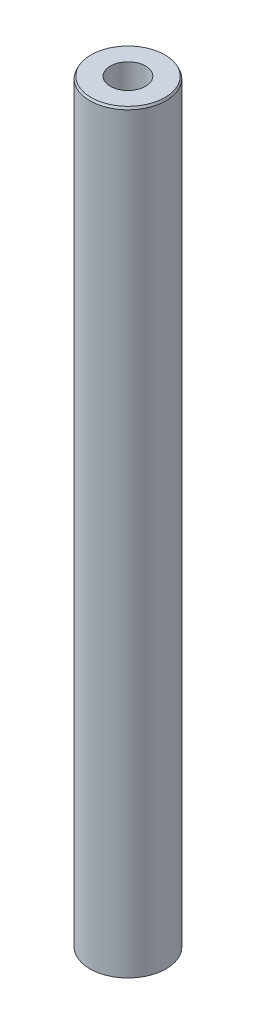
ISO-10303-21;
HEADER;
FILE_DESCRIPTION(('STEP AP214'),'2;1');
FILE_NAME('part.step','',(''),(''),'','','');
FILE_SCHEMA(('AUTOMOTIVE_DESIGN { 1 0 10303 214 1 1 1 1 }'));
ENDSEC;
DATA;
#1=APPLICATION_CONTEXT('core data for automotive mechanical design processes');
#2=APPLICATION_PROTOCOL_DEFINITION('international standard','automotive_design',2000,#1);
#3=PRODUCT_CONTEXT('',#1,'mechanical');
#4=PRODUCT('Part','Part','',(#3));
#5=PRODUCT_RELATED_PRODUCT_CATEGORY('part','',(#4));
#6=PRODUCT_DEFINITION_FORMATION('','',#4);
#7=PRODUCT_DEFINITION_CONTEXT('part definition',#1,'design');
#8=PRODUCT_DEFINITION('design','',#6,#7);
#9=PRODUCT_DEFINITION_SHAPE('','',#8);
#10=(LENGTH_UNIT() NAMED_UNIT(*) SI_UNIT(.MILLI.,.METRE.));
#11=(NAMED_UNIT(*) PLANE_ANGLE_UNIT() SI_UNIT($,.RADIAN.));
#12=(NAMED_UNIT(*) SI_UNIT($,.STERADIAN.) SOLID_ANGLE_UNIT());
#13=UNCERTAINTY_MEASURE_WITH_UNIT(LENGTH_MEASURE(1.E-05),#10,'distance_accuracy_value','');
#14=(GEOMETRIC_REPRESENTATION_CONTEXT(3) GLOBAL_UNCERTAINTY_ASSIGNED_CONTEXT((#13)) GLOBAL_UNIT_ASSIGNED_CONTEXT((#10,
#11,#12)) REPRESENTATION_CONTEXT('',''));
#15=CARTESIAN_POINT('',(0.,0.,0.));
#16=DIRECTION('',(0.,0.,1.));
#17=DIRECTION('',(1.,0.,0.));
#18=AXIS2_PLACEMENT_3D('',#15,#16,#17);
#19=CARTESIAN_POINT('',(0.,99.1269780495426,0.));
#20=DIRECTION('',(0.,-1.,0.));
#21=DIRECTION('',(0.,0.,-1.));
#22=AXIS2_PLACEMENT_3D('',#19,#20,#21);
#23=CYLINDRICAL_SURFACE('',#22,5.);
#24=CARTESIAN_POINT('',(0.,98.8356397806549,0.));
#25=DIRECTION('',(0.,1.,0.));
#26=DIRECTION('',(0.,0.,1.));
#27=AXIS2_PLACEMENT_3D('',#24,#25,#26);
#28=CIRCLE('',#27,5.);
#29=CARTESIAN_POINT('',(0.,98.8356397806549,5.));
#30=VERTEX_POINT('',#29);
#31=EDGE_CURVE('E50',#30,#30,#28,.F.);
#32=ORIENTED_EDGE('',*,*,#31,.T.);
#33=EDGE_LOOP('',(#32));
#34=FACE_BOUND('',#33,.T.);
#35=CARTESIAN_POINT('',(0.,0.150529226811025,0.));
#36=DIRECTION('',(0.,1.,0.));
#37=DIRECTION('',(0.,0.,1.));
#38=AXIS2_PLACEMENT_3D('',#35,#36,#37);
#39=CIRCLE('',#38,5.);
#40=CARTESIAN_POINT('',(0.,0.150529226811025,5.));
#41=VERTEX_POINT('',#40);
#42=EDGE_CURVE('E51',#41,#41,#39,.T.);
#43=ORIENTED_EDGE('',*,*,#42,.T.);
#44=EDGE_LOOP('',(#43));
#45=FACE_BOUND('',#44,.T.);
#46=ADVANCED_FACE('F39',(#34,#45),#23,.T.);
#47=CARTESIAN_POINT('',(0.,99.1269780495426,0.));
#48=DIRECTION('',(0.,1.,0.));
#49=DIRECTION('',(0.,0.,1.));
#50=AXIS2_PLACEMENT_3D('',#47,#48,#49);
#51=PLANE('',#50);
#52=CARTESIAN_POINT('',(0.,99.1269780495426,0.));
#53=DIRECTION('',(0.,1.,0.));
#54=DIRECTION('',(0.,0.,1.));
#55=AXIS2_PLACEMENT_3D('',#52,#53,#54);
#56=CIRCLE('',#55,4.84947077318897);
#57=CARTESIAN_POINT('',(0.,99.1269780495426,4.84947077318897));
#58=VERTEX_POINT('',#57);
#59=EDGE_CURVE('E54',#58,#58,#56,.T.);
#60=ORIENTED_EDGE('',*,*,#59,.T.);
#61=EDGE_LOOP('',(#60));
#62=FACE_BOUND('',#61,.T.);
#63=CARTESIAN_POINT('',(0.,99.1269780495426,0.));
#64=DIRECTION('',(0.,1.,0.));
#65=DIRECTION('',(0.,0.,1.));
#66=AXIS2_PLACEMENT_3D('',#63,#64,#65);
#67=CIRCLE('',#66,2.31005684895289);
#68=CARTESIAN_POINT('',(0.,99.1269780495426,2.31005684895289));
#69=VERTEX_POINT('',#68);
#70=EDGE_CURVE('E58',#69,#69,#67,.T.);
#71=ORIENTED_EDGE('',*,*,#70,.F.);
#72=EDGE_LOOP('',(#71));
#73=FACE_BOUND('',#72,.T.);
#74=ADVANCED_FACE('F69',(#62,#73),#51,.T.);
#75=CARTESIAN_POINT('',(0.,0.,0.));
#76=DIRECTION('',(0.,1.,0.));
#77=DIRECTION('',(0.,0.,1.));
#78=AXIS2_PLACEMENT_3D('',#75,#76,#77);
#79=PLANE('',#78);
#80=CARTESIAN_POINT('',(0.,0.,0.));
#81=DIRECTION('',(0.,1.,0.));
#82=DIRECTION('',(0.,0.,1.));
#83=AXIS2_PLACEMENT_3D('',#80,#81,#82);
#84=CIRCLE('',#83,4.70866173111237);
#85=CARTESIAN_POINT('',(0.,0.,4.70866173111237));
#86=VERTEX_POINT('',#85);
#87=EDGE_CURVE('E10',#86,#86,#84,.F.);
#88=ORIENTED_EDGE('',*,*,#87,.T.);
#89=EDGE_LOOP('',(#88));
#90=FACE_BOUND('',#89,.T.);
#91=CARTESIAN_POINT('',(0.,0.,0.));
#92=DIRECTION('',(0.,1.,0.));
#93=DIRECTION('',(0.,0.,1.));
#94=AXIS2_PLACEMENT_3D('',#91,#92,#93);
#95=CIRCLE('',#94,2.31005684895289);
#96=CARTESIAN_POINT('',(0.,0.,2.31005684895289));
#97=VERTEX_POINT('',#96);
#98=EDGE_CURVE('E63',#97,#97,#95,.T.);
#99=ORIENTED_EDGE('',*,*,#98,.T.);
#100=EDGE_LOOP('',(#99));
#101=FACE_BOUND('',#100,.T.);
#102=ADVANCED_FACE('F75',(#90,#101),#79,.F.);
#103=CARTESIAN_POINT('',(0.,99.1269780495426,0.));
#104=DIRECTION('',(0.,-1.,0.));
#105=DIRECTION('',(0.,0.,-1.));
#106=AXIS2_PLACEMENT_3D('',#103,#104,#105);
#107=CYLINDRICAL_SURFACE('',#106,2.31005684895289);
#108=ORIENTED_EDGE('',*,*,#70,.T.);
#109=EDGE_LOOP('',(#108));
#110=FACE_BOUND('',#109,.T.);
#111=ORIENTED_EDGE('',*,*,#98,.F.);
#112=EDGE_LOOP('',(#111));
#113=FACE_BOUND('',#112,.T.);
#114=ADVANCED_FACE('F70',(#110,#113),#107,.F.);
#115=CARTESIAN_POINT('',(0.,99.1269780495426,0.));
#116=DIRECTION('',(0.,-1.,0.));
#117=DIRECTION('',(0.,0.,-1.));
#118=AXIS2_PLACEMENT_3D('',#115,#116,#117);
#119=CONICAL_SURFACE('',#118,4.84947077318897,0.476903935969994);
#120=ORIENTED_EDGE('',*,*,#31,.F.);
#121=EDGE_LOOP('',(#120));
#122=FACE_BOUND('',#121,.T.);
#123=ORIENTED_EDGE('',*,*,#59,.F.);
#124=EDGE_LOOP('',(#123));
#125=FACE_BOUND('',#124,.T.);
#126=ADVANCED_FACE('F81',(#122,#125),#119,.T.);
#127=CARTESIAN_POINT('',(0.,0.150529226811025,0.));
#128=DIRECTION('',(0.,1.,0.));
#129=DIRECTION('',(0.,0.,1.));
#130=AXIS2_PLACEMENT_3D('',#127,#128,#129);
#131=CONICAL_SURFACE('',#130,5.,1.09389239082488);
#132=ORIENTED_EDGE('',*,*,#87,.F.);
#133=EDGE_LOOP('',(#132));
#134=FACE_BOUND('',#133,.T.);
#135=ORIENTED_EDGE('',*,*,#42,.F.);
#136=EDGE_LOOP('',(#135));
#137=FACE_BOUND('',#136,.T.);
#138=ADVANCED_FACE('F45',(#134,#137),#131,.T.);
#139=CLOSED_SHELL('',(#46,#74,#102,#114,#126,#138));
#140=MANIFOLD_SOLID_BREP('B2',#139);
#141=ADVANCED_BREP_SHAPE_REPRESENTATION('',(#18,#140),#14);
#142=SHAPE_DEFINITION_REPRESENTATION(#9,#141);
ENDSEC;
END-ISO-10303-21;
